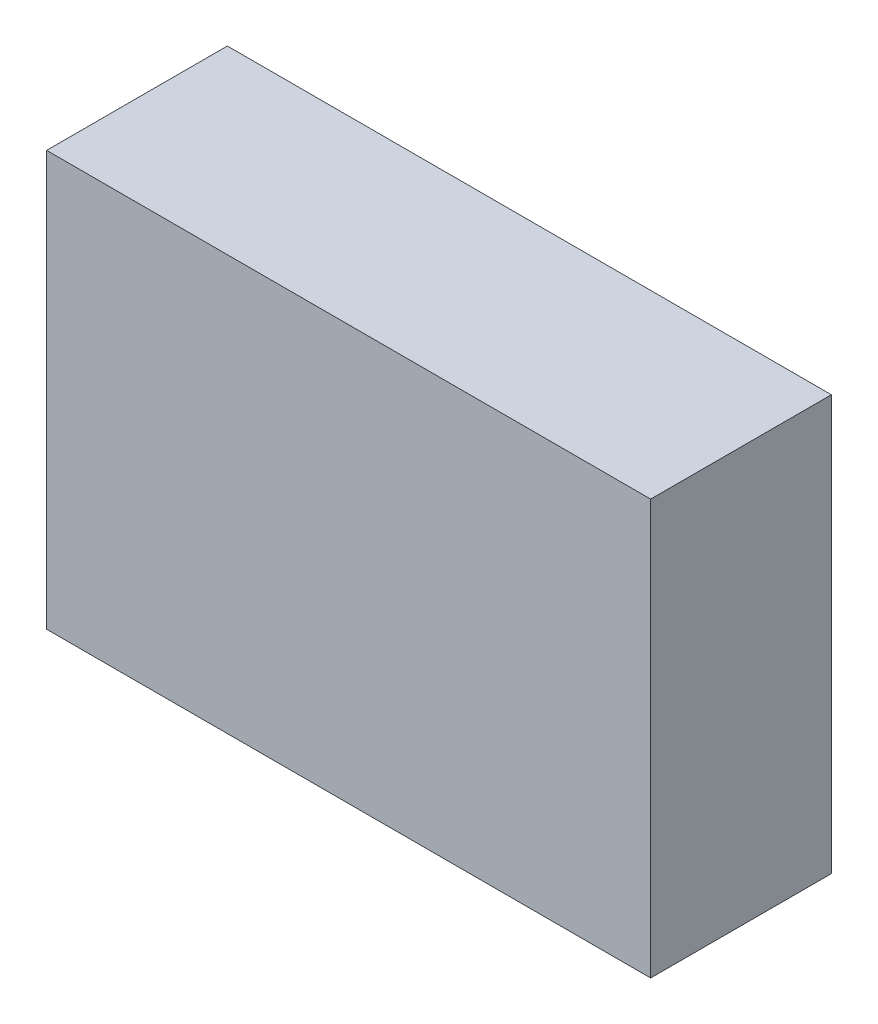
ISO-10303-21;
HEADER;
FILE_DESCRIPTION(('STEP AP214'),'2;1');
FILE_NAME('part.step','',(''),(''),'','','');
FILE_SCHEMA(('AUTOMOTIVE_DESIGN { 1 0 10303 214 1 1 1 1 }'));
ENDSEC;
DATA;
#1=APPLICATION_CONTEXT('core data for automotive mechanical design processes');
#2=APPLICATION_PROTOCOL_DEFINITION('international standard','automotive_design',2000,#1);
#3=PRODUCT_CONTEXT('',#1,'mechanical');
#4=PRODUCT('Part','Part','',(#3));
#5=PRODUCT_RELATED_PRODUCT_CATEGORY('part','',(#4));
#6=PRODUCT_DEFINITION_FORMATION('','',#4);
#7=PRODUCT_DEFINITION_CONTEXT('part definition',#1,'design');
#8=PRODUCT_DEFINITION('design','',#6,#7);
#9=PRODUCT_DEFINITION_SHAPE('','',#8);
#10=(LENGTH_UNIT() NAMED_UNIT(*) SI_UNIT(.MILLI.,.METRE.));
#11=(NAMED_UNIT(*) PLANE_ANGLE_UNIT() SI_UNIT($,.RADIAN.));
#12=(NAMED_UNIT(*) SI_UNIT($,.STERADIAN.) SOLID_ANGLE_UNIT());
#13=UNCERTAINTY_MEASURE_WITH_UNIT(LENGTH_MEASURE(1.E-05),#10,'distance_accuracy_value','');
#14=(GEOMETRIC_REPRESENTATION_CONTEXT(3) GLOBAL_UNCERTAINTY_ASSIGNED_CONTEXT((#13)) GLOBAL_UNIT_ASSIGNED_CONTEXT((#10,
#11,#12)) REPRESENTATION_CONTEXT('',''));
#15=CARTESIAN_POINT('',(0.,0.,0.));
#16=DIRECTION('',(0.,0.,1.));
#17=DIRECTION('',(1.,0.,0.));
#18=AXIS2_PLACEMENT_3D('',#15,#16,#17);
#19=CARTESIAN_POINT('',(-0.635,0.43600116,0.37999924));
#20=DIRECTION('',(0.,0.,1.));
#21=DIRECTION('',(1.,0.,0.));
#22=AXIS2_PLACEMENT_3D('',#19,#20,#21);
#23=PLANE('',#22);
#24=DIRECTION('',(0.,1.,0.));
#25=VECTOR('',#24,1.);
#26=CARTESIAN_POINT('',(0.635,0.43600116,0.37999924));
#27=LINE('',#26,#25);
#28=CARTESIAN_POINT('',(0.635,0.43600116,0.37999924));
#29=VERTEX_POINT('',#28);
#30=CARTESIAN_POINT('',(0.635,-0.43600116,0.37999924));
#31=VERTEX_POINT('',#30);
#32=EDGE_CURVE('E52',#29,#31,#27,.F.);
#33=ORIENTED_EDGE('',*,*,#32,.F.);
#34=DIRECTION('',(1.,0.,0.));
#35=VECTOR('',#34,1.);
#36=CARTESIAN_POINT('',(-0.635,0.43600116,0.37999924));
#37=LINE('',#36,#35);
#38=CARTESIAN_POINT('',(-0.635,0.43600116,0.37999924));
#39=VERTEX_POINT('',#38);
#40=EDGE_CURVE('E67',#39,#29,#37,.T.);
#41=ORIENTED_EDGE('',*,*,#40,.F.);
#42=DIRECTION('',(0.,1.,0.));
#43=VECTOR('',#42,1.);
#44=CARTESIAN_POINT('',(-0.635,-0.43600116,0.37999924));
#45=LINE('',#44,#43);
#46=CARTESIAN_POINT('',(-0.635,-0.43600116,0.37999924));
#47=VERTEX_POINT('',#46);
#48=EDGE_CURVE('E19',#47,#39,#45,.T.);
#49=ORIENTED_EDGE('',*,*,#48,.F.);
#50=DIRECTION('',(1.,0.,0.));
#51=VECTOR('',#50,1.);
#52=CARTESIAN_POINT('',(0.635,-0.43600116,0.37999924));
#53=LINE('',#52,#51);
#54=EDGE_CURVE('E57',#31,#47,#53,.F.);
#55=ORIENTED_EDGE('',*,*,#54,.F.);
#56=EDGE_LOOP('',(#33,#41,#49,#55));
#57=FACE_BOUND('',#56,.T.);
#58=ADVANCED_FACE('F16',(#57),#23,.T.);
#59=CARTESIAN_POINT('',(-0.635,-0.43600116,0.));
#60=DIRECTION('',(-1.,0.,0.));
#61=DIRECTION('',(0.,0.,1.));
#62=AXIS2_PLACEMENT_3D('',#59,#60,#61);
#63=PLANE('',#62);
#64=DIRECTION('',(0.,0.,1.));
#65=VECTOR('',#64,1.);
#66=CARTESIAN_POINT('',(-0.635,0.43600116,0.));
#67=LINE('',#66,#65);
#68=CARTESIAN_POINT('',(-0.635,0.43600116,0.));
#69=VERTEX_POINT('',#68);
#70=EDGE_CURVE('E78',#69,#39,#67,.T.);
#71=ORIENTED_EDGE('',*,*,#70,.F.);
#72=DIRECTION('',(0.,1.,0.));
#73=VECTOR('',#72,1.);
#74=CARTESIAN_POINT('',(-0.635,0.43600116,0.));
#75=LINE('',#74,#73);
#76=CARTESIAN_POINT('',(-0.635,-0.43600116,0.));
#77=VERTEX_POINT('',#76);
#78=EDGE_CURVE('E73',#69,#77,#75,.F.);
#79=ORIENTED_EDGE('',*,*,#78,.T.);
#80=DIRECTION('',(0.,0.,-1.));
#81=VECTOR('',#80,1.);
#82=CARTESIAN_POINT('',(-0.635,-0.43600116,0.));
#83=LINE('',#82,#81);
#84=EDGE_CURVE('E62',#47,#77,#83,.T.);
#85=ORIENTED_EDGE('',*,*,#84,.F.);
#86=ORIENTED_EDGE('',*,*,#48,.T.);
#87=EDGE_LOOP('',(#71,#79,#85,#86));
#88=FACE_BOUND('',#87,.T.);
#89=ADVANCED_FACE('F72',(#88),#63,.T.);
#90=CARTESIAN_POINT('',(0.635,-0.43600116,0.));
#91=DIRECTION('',(0.,-1.,0.));
#92=DIRECTION('',(0.,0.,-1.));
#93=AXIS2_PLACEMENT_3D('',#90,#91,#92);
#94=PLANE('',#93);
#95=ORIENTED_EDGE('',*,*,#84,.T.);
#96=DIRECTION('',(1.,0.,0.));
#97=VECTOR('',#96,1.);
#98=CARTESIAN_POINT('',(-0.635,-0.43600116,0.));
#99=LINE('',#98,#97);
#100=CARTESIAN_POINT('',(0.635,-0.43600116,0.));
#101=VERTEX_POINT('',#100);
#102=EDGE_CURVE('E83',#77,#101,#99,.T.);
#103=ORIENTED_EDGE('',*,*,#102,.T.);
#104=DIRECTION('',(0.,0.,-1.));
#105=VECTOR('',#104,1.);
#106=CARTESIAN_POINT('',(0.635,-0.43600116,0.));
#107=LINE('',#106,#105);
#108=EDGE_CURVE('E64',#31,#101,#107,.T.);
#109=ORIENTED_EDGE('',*,*,#108,.F.);
#110=ORIENTED_EDGE('',*,*,#54,.T.);
#111=EDGE_LOOP('',(#95,#103,#109,#110));
#112=FACE_BOUND('',#111,.T.);
#113=ADVANCED_FACE('F59',(#112),#94,.T.);
#114=CARTESIAN_POINT('',(0.635,0.43600116,0.));
#115=DIRECTION('',(1.,0.,0.));
#116=DIRECTION('',(0.,0.,-1.));
#117=AXIS2_PLACEMENT_3D('',#114,#115,#116);
#118=PLANE('',#117);
#119=ORIENTED_EDGE('',*,*,#108,.T.);
#120=DIRECTION('',(0.,1.,0.));
#121=VECTOR('',#120,1.);
#122=CARTESIAN_POINT('',(0.635,0.43600116,0.));
#123=LINE('',#122,#121);
#124=CARTESIAN_POINT('',(0.635,0.43600116,0.));
#125=VERTEX_POINT('',#124);
#126=EDGE_CURVE('E25',#101,#125,#123,.T.);
#127=ORIENTED_EDGE('',*,*,#126,.T.);
#128=DIRECTION('',(0.,0.,1.));
#129=VECTOR('',#128,1.);
#130=CARTESIAN_POINT('',(0.635,0.43600116,0.));
#131=LINE('',#130,#129);
#132=EDGE_CURVE('E33',#29,#125,#131,.F.);
#133=ORIENTED_EDGE('',*,*,#132,.F.);
#134=ORIENTED_EDGE('',*,*,#32,.T.);
#135=EDGE_LOOP('',(#119,#127,#133,#134));
#136=FACE_BOUND('',#135,.T.);
#137=ADVANCED_FACE('F87',(#136),#118,.T.);
#138=CARTESIAN_POINT('',(-0.635,0.43600116,0.));
#139=DIRECTION('',(0.,1.,0.));
#140=DIRECTION('',(0.,0.,1.));
#141=AXIS2_PLACEMENT_3D('',#138,#139,#140);
#142=PLANE('',#141);
#143=ORIENTED_EDGE('',*,*,#132,.T.);
#144=DIRECTION('',(1.,0.,0.));
#145=VECTOR('',#144,1.);
#146=CARTESIAN_POINT('',(-0.635,0.43600116,0.));
#147=LINE('',#146,#145);
#148=EDGE_CURVE('E10',#125,#69,#147,.F.);
#149=ORIENTED_EDGE('',*,*,#148,.T.);
#150=ORIENTED_EDGE('',*,*,#70,.T.);
#151=ORIENTED_EDGE('',*,*,#40,.T.);
#152=EDGE_LOOP('',(#143,#149,#150,#151));
#153=FACE_BOUND('',#152,.T.);
#154=ADVANCED_FACE('F90',(#153),#142,.T.);
#155=CARTESIAN_POINT('',(-0.635,0.43600116,0.));
#156=DIRECTION('',(0.,0.,1.));
#157=DIRECTION('',(1.,0.,0.));
#158=AXIS2_PLACEMENT_3D('',#155,#156,#157);
#159=PLANE('',#158);
#160=ORIENTED_EDGE('',*,*,#126,.F.);
#161=ORIENTED_EDGE('',*,*,#102,.F.);
#162=ORIENTED_EDGE('',*,*,#78,.F.);
#163=ORIENTED_EDGE('',*,*,#148,.F.);
#164=EDGE_LOOP('',(#160,#161,#162,#163));
#165=FACE_BOUND('',#164,.T.);
#166=ADVANCED_FACE('F89',(#165),#159,.F.);
#167=CLOSED_SHELL('',(#58,#89,#113,#137,#154,#166));
#168=MANIFOLD_SOLID_BREP('B1',#167);
#169=ADVANCED_BREP_SHAPE_REPRESENTATION('',(#18,#168),#14);
#170=SHAPE_DEFINITION_REPRESENTATION(#9,#169);
ENDSEC;
END-ISO-10303-21;
